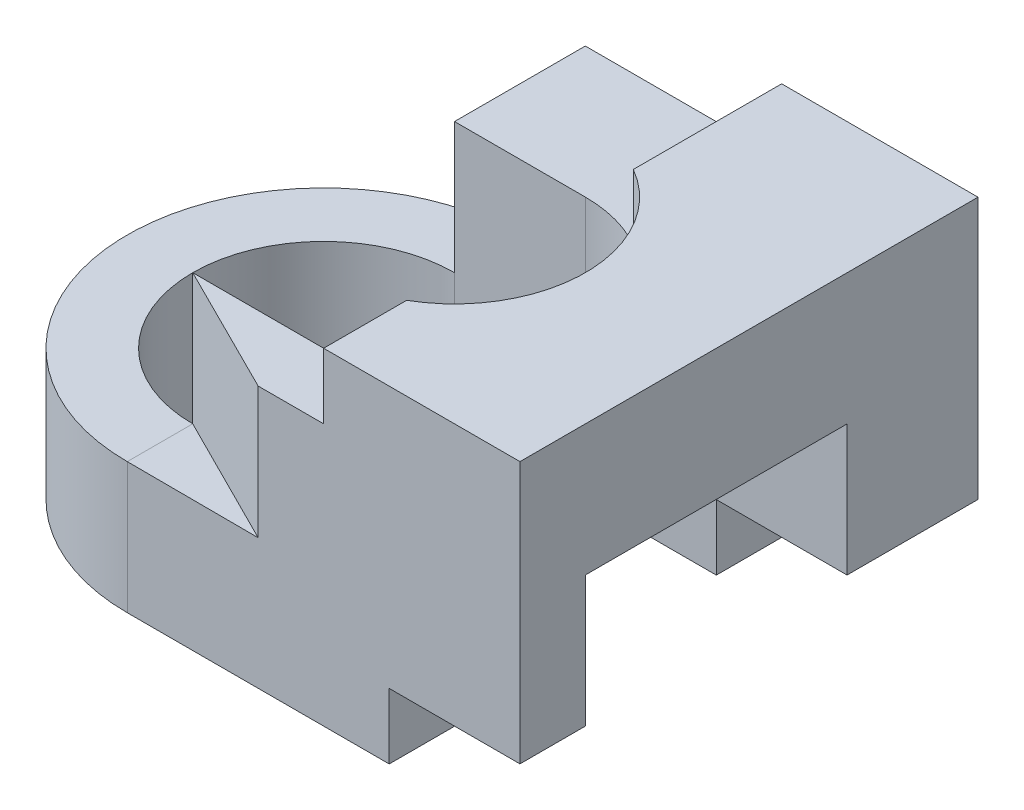
ISO-10303-21;
HEADER;
FILE_DESCRIPTION(('STEP AP214'),'2;1');
FILE_NAME('part.step','',(''),(''),'','','');
FILE_SCHEMA(('AUTOMOTIVE_DESIGN { 1 0 10303 214 1 1 1 1 }'));
ENDSEC;
DATA;
#1=APPLICATION_CONTEXT('core data for automotive mechanical design processes');
#2=APPLICATION_PROTOCOL_DEFINITION('international standard','automotive_design',2000,#1);
#3=PRODUCT_CONTEXT('',#1,'mechanical');
#4=PRODUCT('Part','Part','',(#3));
#5=PRODUCT_RELATED_PRODUCT_CATEGORY('part','',(#4));
#6=PRODUCT_DEFINITION_FORMATION('','',#4);
#7=PRODUCT_DEFINITION_CONTEXT('part definition',#1,'design');
#8=PRODUCT_DEFINITION('design','',#6,#7);
#9=PRODUCT_DEFINITION_SHAPE('','',#8);
#10=(LENGTH_UNIT() NAMED_UNIT(*) SI_UNIT(.MILLI.,.METRE.));
#11=(NAMED_UNIT(*) PLANE_ANGLE_UNIT() SI_UNIT($,.RADIAN.));
#12=(NAMED_UNIT(*) SI_UNIT($,.STERADIAN.) SOLID_ANGLE_UNIT());
#13=UNCERTAINTY_MEASURE_WITH_UNIT(LENGTH_MEASURE(1.E-05),#10,'distance_accuracy_value','');
#14=(GEOMETRIC_REPRESENTATION_CONTEXT(3) GLOBAL_UNCERTAINTY_ASSIGNED_CONTEXT((#13)) GLOBAL_UNIT_ASSIGNED_CONTEXT((#10,
#11,#12)) REPRESENTATION_CONTEXT('',''));
#15=CARTESIAN_POINT('',(0.,0.,0.));
#16=DIRECTION('',(0.,0.,1.));
#17=DIRECTION('',(1.,0.,0.));
#18=AXIS2_PLACEMENT_3D('',#15,#16,#17);
#19=CARTESIAN_POINT('',(4.00235173542104,1.,3.));
#20=DIRECTION('',(-1.,0.,0.));
#21=DIRECTION('',(0.,0.,1.));
#22=AXIS2_PLACEMENT_3D('',#19,#20,#21);
#23=PLANE('',#22);
#24=DIRECTION('',(0.,0.,-1.));
#25=VECTOR('',#24,1.);
#26=CARTESIAN_POINT('',(4.00235173542104,0.,3.));
#27=LINE('',#26,#25);
#28=CARTESIAN_POINT('',(4.00235173542104,0.,3.));
#29=VERTEX_POINT('',#28);
#30=CARTESIAN_POINT('',(4.00235173542104,0.,2.));
#31=VERTEX_POINT('',#30);
#32=EDGE_CURVE('E255',#29,#31,#27,.T.);
#33=ORIENTED_EDGE('',*,*,#32,.T.);
#34=DIRECTION('',(0.,1.,0.));
#35=VECTOR('',#34,1.);
#36=CARTESIAN_POINT('',(4.00235173542104,1.,2.));
#37=LINE('',#36,#35);
#38=CARTESIAN_POINT('',(4.00235173542104,1.,2.));
#39=VERTEX_POINT('',#38);
#40=EDGE_CURVE('E236',#31,#39,#37,.T.);
#41=ORIENTED_EDGE('',*,*,#40,.T.);
#42=DIRECTION('',(0.,0.,-1.));
#43=VECTOR('',#42,1.);
#44=CARTESIAN_POINT('',(4.00235173542104,1.,3.));
#45=LINE('',#44,#43);
#46=CARTESIAN_POINT('',(4.00235173542104,1.,3.));
#47=VERTEX_POINT('',#46);
#48=EDGE_CURVE('E250',#47,#39,#45,.T.);
#49=ORIENTED_EDGE('',*,*,#48,.F.);
#50=DIRECTION('',(0.,-1.,0.));
#51=VECTOR('',#50,1.);
#52=CARTESIAN_POINT('',(4.00235173542104,1.,3.));
#53=LINE('',#52,#51);
#54=EDGE_CURVE('E254',#47,#29,#53,.T.);
#55=ORIENTED_EDGE('',*,*,#54,.T.);
#56=EDGE_LOOP('',(#33,#41,#49,#55));
#57=FACE_BOUND('',#56,.T.);
#58=ADVANCED_FACE('F34',(#57),#23,.F.);
#59=CARTESIAN_POINT('',(0.,1.,0.));
#60=DIRECTION('',(0.,1.,0.));
#61=DIRECTION('',(0.,0.,1.));
#62=AXIS2_PLACEMENT_3D('',#59,#60,#61);
#63=PLANE('',#62);
#64=ORIENTED_EDGE('',*,*,#48,.T.);
#65=DIRECTION('',(1.,0.,0.));
#66=VECTOR('',#65,1.);
#67=CARTESIAN_POINT('',(0.,1.,2.));
#68=LINE('',#67,#66);
#69=CARTESIAN_POINT('',(6.,1.,2.));
#70=VERTEX_POINT('',#69);
#71=EDGE_CURVE('E12',#39,#70,#68,.T.);
#72=ORIENTED_EDGE('',*,*,#71,.T.);
#73=DIRECTION('',(0.,0.,1.));
#74=VECTOR('',#73,1.);
#75=CARTESIAN_POINT('',(6.,1.,3.));
#76=LINE('',#75,#74);
#77=CARTESIAN_POINT('',(6.,1.,3.));
#78=VERTEX_POINT('',#77);
#79=EDGE_CURVE('E246',#70,#78,#76,.T.);
#80=ORIENTED_EDGE('',*,*,#79,.T.);
#81=DIRECTION('',(-1.,0.,0.));
#82=VECTOR('',#81,1.);
#83=CARTESIAN_POINT('',(6.,1.,3.));
#84=LINE('',#83,#82);
#85=EDGE_CURVE('E245',#78,#47,#84,.T.);
#86=ORIENTED_EDGE('',*,*,#85,.T.);
#87=EDGE_LOOP('',(#64,#72,#80,#86));
#88=FACE_BOUND('',#87,.T.);
#89=ADVANCED_FACE('F440',(#88),#63,.F.);
#90=CARTESIAN_POINT('',(0.,5.,0.));
#91=DIRECTION('',(0.,1.,0.));
#92=DIRECTION('',(0.,0.,1.));
#93=AXIS2_PLACEMENT_3D('',#90,#91,#92);
#94=PLANE('',#93);
#95=DIRECTION('',(-1.,0.,0.));
#96=VECTOR('',#95,1.);
#97=CARTESIAN_POINT('',(0.,5.,-3.99836020882143));
#98=LINE('',#97,#96);
#99=CARTESIAN_POINT('',(6.,5.,-3.99836020882143));
#100=VERTEX_POINT('',#99);
#101=CARTESIAN_POINT('',(3.,5.,-3.99836020882143));
#102=VERTEX_POINT('',#101);
#103=EDGE_CURVE('E323',#100,#102,#98,.T.);
#104=ORIENTED_EDGE('',*,*,#103,.T.);
#105=DIRECTION('',(0.,0.,1.));
#106=VECTOR('',#105,1.);
#107=CARTESIAN_POINT('',(3.,5.,-4.));
#108=LINE('',#107,#106);
#109=CARTESIAN_POINT('',(3.,5.,-1.73205080756888));
#110=VERTEX_POINT('',#109);
#111=EDGE_CURVE('E271',#102,#110,#108,.T.);
#112=ORIENTED_EDGE('',*,*,#111,.T.);
#113=CARTESIAN_POINT('',(2.,5.,0.));
#114=DIRECTION('',(0.,1.,0.));
#115=DIRECTION('',(0.,0.,-1.));
#116=AXIS2_PLACEMENT_3D('',#113,#114,#115);
#117=CIRCLE('',#116,2.);
#118=CARTESIAN_POINT('',(3.,5.,1.73205080756888));
#119=VERTEX_POINT('',#118);
#120=EDGE_CURVE('E296',#119,#110,#117,.T.);
#121=ORIENTED_EDGE('',*,*,#120,.F.);
#122=CARTESIAN_POINT('',(3.,5.,3.));
#123=VERTEX_POINT('',#122);
#124=EDGE_CURVE('E391',#119,#123,#108,.T.);
#125=ORIENTED_EDGE('',*,*,#124,.T.);
#126=DIRECTION('',(1.,0.,0.));
#127=VECTOR('',#126,1.);
#128=CARTESIAN_POINT('',(6.,5.,3.));
#129=LINE('',#128,#127);
#130=CARTESIAN_POINT('',(6.,5.,3.));
#131=VERTEX_POINT('',#130);
#132=EDGE_CURVE('E318',#123,#131,#129,.T.);
#133=ORIENTED_EDGE('',*,*,#132,.T.);
#134=DIRECTION('',(0.,0.,-1.));
#135=VECTOR('',#134,1.);
#136=CARTESIAN_POINT('',(6.,5.,-3.99836020882143));
#137=LINE('',#136,#135);
#138=EDGE_CURVE('E320',#131,#100,#137,.T.);
#139=ORIENTED_EDGE('',*,*,#138,.T.);
#140=EDGE_LOOP('',(#104,#112,#121,#125,#133,#139));
#141=FACE_BOUND('',#140,.T.);
#142=ADVANCED_FACE('F397',(#141),#94,.T.);
#143=CARTESIAN_POINT('',(0.,5.,0.));
#144=DIRECTION('',(0.,-1.,0.));
#145=DIRECTION('',(0.,0.,-1.));
#146=AXIS2_PLACEMENT_3D('',#143,#144,#145);
#147=CYLINDRICAL_SURFACE('',#146,3.);
#148=CARTESIAN_POINT('',(0.,2.,0.));
#149=DIRECTION('',(0.,1.,0.));
#150=DIRECTION('',(-1.,0.,0.));
#151=AXIS2_PLACEMENT_3D('',#148,#149,#150);
#152=CIRCLE('',#151,3.);
#153=CARTESIAN_POINT('',(0.,2.,-3.));
#154=VERTEX_POINT('',#153);
#155=CARTESIAN_POINT('',(0.,2.,3.));
#156=VERTEX_POINT('',#155);
#157=EDGE_CURVE('E293',#154,#156,#152,.T.);
#158=ORIENTED_EDGE('',*,*,#157,.F.);
#159=DIRECTION('',(0.,-1.,0.));
#160=VECTOR('',#159,1.);
#161=CARTESIAN_POINT('',(0.,5.,-3.));
#162=LINE('',#161,#160);
#163=CARTESIAN_POINT('',(0.,0.,-3.));
#164=VERTEX_POINT('',#163);
#165=EDGE_CURVE('E326',#154,#164,#162,.T.);
#166=ORIENTED_EDGE('',*,*,#165,.T.);
#167=CARTESIAN_POINT('',(0.,0.,0.));
#168=DIRECTION('',(0.,1.,0.));
#169=DIRECTION('',(0.,0.,1.));
#170=AXIS2_PLACEMENT_3D('',#167,#168,#169);
#171=CIRCLE('',#170,3.);
#172=CARTESIAN_POINT('',(0.,0.,3.));
#173=VERTEX_POINT('',#172);
#174=EDGE_CURVE('E327',#164,#173,#171,.T.);
#175=ORIENTED_EDGE('',*,*,#174,.T.);
#176=DIRECTION('',(0.,-1.,0.));
#177=VECTOR('',#176,1.);
#178=CARTESIAN_POINT('',(0.,5.,3.));
#179=LINE('',#178,#177);
#180=EDGE_CURVE('E347',#156,#173,#179,.T.);
#181=ORIENTED_EDGE('',*,*,#180,.F.);
#182=EDGE_LOOP('',(#158,#166,#175,#181));
#183=FACE_BOUND('',#182,.T.);
#184=ADVANCED_FACE('F36',(#183),#147,.T.);
#185=CARTESIAN_POINT('',(6.,5.,3.));
#186=DIRECTION('',(0.,0.,-1.));
#187=DIRECTION('',(-1.,0.,0.));
#188=AXIS2_PLACEMENT_3D('',#185,#186,#187);
#189=PLANE('',#188);
#190=DIRECTION('',(-1.,0.,0.));
#191=VECTOR('',#190,1.);
#192=CARTESIAN_POINT('',(0.,4.,3.));
#193=LINE('',#192,#191);
#194=CARTESIAN_POINT('',(3.,4.,3.));
#195=VERTEX_POINT('',#194);
#196=CARTESIAN_POINT('',(2.,4.,3.));
#197=VERTEX_POINT('',#196);
#198=EDGE_CURVE('E208',#195,#197,#193,.T.);
#199=ORIENTED_EDGE('',*,*,#198,.T.);
#200=DIRECTION('',(0.,1.,0.));
#201=VECTOR('',#200,1.);
#202=CARTESIAN_POINT('',(2.,4.,3.));
#203=LINE('',#202,#201);
#204=CARTESIAN_POINT('',(2.,1.99251811698804,3.));
#205=VERTEX_POINT('',#204);
#206=EDGE_CURVE('E199',#205,#197,#203,.T.);
#207=ORIENTED_EDGE('',*,*,#206,.F.);
#208=DIRECTION('',(-0.999993002751767,0.00374091532968507,0.));
#209=VECTOR('',#208,1.);
#210=CARTESIAN_POINT('',(5.98869336585426,1.97759664842108,3.));
#211=LINE('',#210,#209);
#212=EDGE_CURVE('E186',#205,#156,#211,.T.);
#213=ORIENTED_EDGE('',*,*,#212,.T.);
#214=ORIENTED_EDGE('',*,*,#180,.T.);
#215=DIRECTION('',(1.,0.,0.));
#216=VECTOR('',#215,1.);
#217=CARTESIAN_POINT('',(6.,0.,3.));
#218=LINE('',#217,#216);
#219=EDGE_CURVE('E330',#173,#29,#218,.T.);
#220=ORIENTED_EDGE('',*,*,#219,.T.);
#221=ORIENTED_EDGE('',*,*,#54,.F.);
#222=ORIENTED_EDGE('',*,*,#85,.F.);
#223=DIRECTION('',(0.,-1.,0.));
#224=VECTOR('',#223,1.);
#225=CARTESIAN_POINT('',(6.,5.,3.));
#226=LINE('',#225,#224);
#227=EDGE_CURVE('E344',#131,#78,#226,.T.);
#228=ORIENTED_EDGE('',*,*,#227,.F.);
#229=ORIENTED_EDGE('',*,*,#132,.F.);
#230=DIRECTION('',(0.,-1.,0.));
#231=VECTOR('',#230,1.);
#232=CARTESIAN_POINT('',(3.,0.,3.));
#233=LINE('',#232,#231);
#234=EDGE_CURVE('E264',#123,#195,#233,.T.);
#235=ORIENTED_EDGE('',*,*,#234,.T.);
#236=EDGE_LOOP('',(#199,#207,#213,#214,#220,#221,#222,#228,#229,#235));
#237=FACE_BOUND('',#236,.T.);
#238=ADVANCED_FACE('F205',(#237),#189,.F.);
#239=CARTESIAN_POINT('',(0.,5.,-3.99836020882143));
#240=DIRECTION('',(0.,0.,1.));
#241=DIRECTION('',(1.,0.,0.));
#242=AXIS2_PLACEMENT_3D('',#239,#240,#241);
#243=PLANE('',#242);
#244=DIRECTION('',(1.,0.,0.));
#245=VECTOR('',#244,1.);
#246=CARTESIAN_POINT('',(6.,1.,-3.99836020882143));
#247=LINE('',#246,#245);
#248=CARTESIAN_POINT('',(4.00235173542104,1.,-3.99836020882143));
#249=VERTEX_POINT('',#248);
#250=CARTESIAN_POINT('',(6.,1.,-3.99836020882143));
#251=VERTEX_POINT('',#250);
#252=EDGE_CURVE('E59',#249,#251,#247,.T.);
#253=ORIENTED_EDGE('',*,*,#252,.F.);
#254=DIRECTION('',(0.,-1.,0.));
#255=VECTOR('',#254,1.);
#256=CARTESIAN_POINT('',(4.00235173542104,1.,-3.99836020882143));
#257=LINE('',#256,#255);
#258=CARTESIAN_POINT('',(4.00235173542104,0.,-3.99836020882143));
#259=VERTEX_POINT('',#258);
#260=EDGE_CURVE('E258',#249,#259,#257,.T.);
#261=ORIENTED_EDGE('',*,*,#260,.T.);
#262=DIRECTION('',(-1.,0.,0.));
#263=VECTOR('',#262,1.);
#264=CARTESIAN_POINT('',(0.,0.,-3.99836020882143));
#265=LINE('',#264,#263);
#266=CARTESIAN_POINT('',(0.,0.,-3.99836020882143));
#267=VERTEX_POINT('',#266);
#268=EDGE_CURVE('E333',#259,#267,#265,.T.);
#269=ORIENTED_EDGE('',*,*,#268,.T.);
#270=DIRECTION('',(0.,-1.,0.));
#271=VECTOR('',#270,1.);
#272=CARTESIAN_POINT('',(0.,5.,-3.99836020882143));
#273=LINE('',#272,#271);
#274=CARTESIAN_POINT('',(0.,4.,-3.99836020882143));
#275=VERTEX_POINT('',#274);
#276=EDGE_CURVE('E338',#275,#267,#273,.T.);
#277=ORIENTED_EDGE('',*,*,#276,.F.);
#278=DIRECTION('',(-1.,0.,0.));
#279=VECTOR('',#278,1.);
#280=CARTESIAN_POINT('',(0.,4.,-3.99836020882143));
#281=LINE('',#280,#279);
#282=CARTESIAN_POINT('',(3.,4.,-3.99836020882143));
#283=VERTEX_POINT('',#282);
#284=EDGE_CURVE('E287',#283,#275,#281,.T.);
#285=ORIENTED_EDGE('',*,*,#284,.F.);
#286=DIRECTION('',(0.,-1.,0.));
#287=VECTOR('',#286,1.);
#288=CARTESIAN_POINT('',(3.,5.,-3.99836020882143));
#289=LINE('',#288,#287);
#290=EDGE_CURVE('E290',#102,#283,#289,.T.);
#291=ORIENTED_EDGE('',*,*,#290,.F.);
#292=ORIENTED_EDGE('',*,*,#103,.F.);
#293=DIRECTION('',(0.,-1.,0.));
#294=VECTOR('',#293,1.);
#295=CARTESIAN_POINT('',(6.,5.,-3.99836020882143));
#296=LINE('',#295,#294);
#297=EDGE_CURVE('E341',#100,#251,#296,.T.);
#298=ORIENTED_EDGE('',*,*,#297,.T.);
#299=EDGE_LOOP('',(#253,#261,#269,#277,#285,#291,#292,#298));
#300=FACE_BOUND('',#299,.T.);
#301=ADVANCED_FACE('F409',(#300),#243,.F.);
#302=CARTESIAN_POINT('',(0.,5.,-3.));
#303=DIRECTION('',(1.,0.,0.));
#304=DIRECTION('',(0.,0.,-1.));
#305=AXIS2_PLACEMENT_3D('',#302,#303,#304);
#306=PLANE('',#305);
#307=ORIENTED_EDGE('',*,*,#165,.F.);
#308=DIRECTION('',(0.,0.,1.));
#309=VECTOR('',#308,1.);
#310=CARTESIAN_POINT('',(0.,2.,-4.));
#311=LINE('',#310,#309);
#312=CARTESIAN_POINT('',(0.,2.,-2.));
#313=VERTEX_POINT('',#312);
#314=EDGE_CURVE('E276',#154,#313,#311,.T.);
#315=ORIENTED_EDGE('',*,*,#314,.T.);
#316=DIRECTION('',(0.,-1.,0.));
#317=VECTOR('',#316,1.);
#318=CARTESIAN_POINT('',(0.,5.,-2.));
#319=LINE('',#318,#317);
#320=CARTESIAN_POINT('',(0.,4.,-2.));
#321=VERTEX_POINT('',#320);
#322=EDGE_CURVE('E310',#321,#313,#319,.T.);
#323=ORIENTED_EDGE('',*,*,#322,.F.);
#324=DIRECTION('',(0.,0.,1.));
#325=VECTOR('',#324,1.);
#326=CARTESIAN_POINT('',(0.,4.,-4.));
#327=LINE('',#326,#325);
#328=EDGE_CURVE('E282',#275,#321,#327,.T.);
#329=ORIENTED_EDGE('',*,*,#328,.F.);
#330=ORIENTED_EDGE('',*,*,#276,.T.);
#331=DIRECTION('',(0.,0.,1.));
#332=VECTOR('',#331,1.);
#333=CARTESIAN_POINT('',(0.,0.,-3.));
#334=LINE('',#333,#332);
#335=EDGE_CURVE('E321',#267,#164,#334,.T.);
#336=ORIENTED_EDGE('',*,*,#335,.T.);
#337=EDGE_LOOP('',(#307,#315,#323,#329,#330,#336));
#338=FACE_BOUND('',#337,.T.);
#339=ADVANCED_FACE('F414',(#338),#306,.F.);
#340=CARTESIAN_POINT('',(0.,5.,0.));
#341=DIRECTION('',(0.,-1.,0.));
#342=DIRECTION('',(0.,0.,-1.));
#343=AXIS2_PLACEMENT_3D('',#340,#341,#342);
#344=CYLINDRICAL_SURFACE('',#343,2.);
#345=CARTESIAN_POINT('',(0.,0.,-2.));
#346=VERTEX_POINT('',#345);
#347=EDGE_CURVE('E299',#313,#346,#319,.T.);
#348=ORIENTED_EDGE('',*,*,#347,.F.);
#349=CARTESIAN_POINT('',(0.,2.,0.));
#350=DIRECTION('',(0.,1.,0.));
#351=DIRECTION('',(-1.,0.,0.));
#352=AXIS2_PLACEMENT_3D('',#349,#350,#351);
#353=CIRCLE('',#352,2.);
#354=CARTESIAN_POINT('',(0.,2.,2.));
#355=VERTEX_POINT('',#354);
#356=EDGE_CURVE('E277',#313,#355,#353,.T.);
#357=ORIENTED_EDGE('',*,*,#356,.T.);
#358=DIRECTION('',(0.,-1.,0.));
#359=VECTOR('',#358,1.);
#360=CARTESIAN_POINT('',(0.,5.,2.));
#361=LINE('',#360,#359);
#362=CARTESIAN_POINT('',(0.,0.,2.));
#363=VERTEX_POINT('',#362);
#364=EDGE_CURVE('E317',#355,#363,#361,.T.);
#365=ORIENTED_EDGE('',*,*,#364,.T.);
#366=CARTESIAN_POINT('',(0.,0.,0.));
#367=DIRECTION('',(0.,1.,0.));
#368=DIRECTION('',(0.,0.,1.));
#369=AXIS2_PLACEMENT_3D('',#366,#367,#368);
#370=CIRCLE('',#369,2.);
#371=EDGE_CURVE('E295',#346,#363,#370,.T.);
#372=ORIENTED_EDGE('',*,*,#371,.F.);
#373=EDGE_LOOP('',(#348,#357,#365,#372));
#374=FACE_BOUND('',#373,.T.);
#375=ADVANCED_FACE('F363',(#374),#344,.F.);
#376=CARTESIAN_POINT('',(2.,5.,2.));
#377=DIRECTION('',(0.,0.,-1.));
#378=DIRECTION('',(-1.,0.,0.));
#379=AXIS2_PLACEMENT_3D('',#376,#377,#378);
#380=PLANE('',#379);
#381=DIRECTION('',(0.,1.,0.));
#382=VECTOR('',#381,1.);
#383=CARTESIAN_POINT('',(0.,5.,2.));
#384=LINE('',#383,#382);
#385=CARTESIAN_POINT('',(0.,4.,2.));
#386=VERTEX_POINT('',#385);
#387=EDGE_CURVE('E202',#355,#386,#384,.T.);
#388=ORIENTED_EDGE('',*,*,#387,.T.);
#389=DIRECTION('',(1.,0.,0.));
#390=VECTOR('',#389,1.);
#391=CARTESIAN_POINT('',(2.,4.,2.));
#392=LINE('',#391,#390);
#393=CARTESIAN_POINT('',(2.,4.,2.));
#394=VERTEX_POINT('',#393);
#395=EDGE_CURVE('E291',#386,#394,#392,.T.);
#396=ORIENTED_EDGE('',*,*,#395,.T.);
#397=DIRECTION('',(0.,-1.,0.));
#398=VECTOR('',#397,1.);
#399=CARTESIAN_POINT('',(2.,5.,2.));
#400=LINE('',#399,#398);
#401=CARTESIAN_POINT('',(2.,3.,2.));
#402=VERTEX_POINT('',#401);
#403=EDGE_CURVE('E314',#394,#402,#400,.T.);
#404=ORIENTED_EDGE('',*,*,#403,.T.);
#405=DIRECTION('',(-1.,0.,0.));
#406=VECTOR('',#405,1.);
#407=CARTESIAN_POINT('',(0.,3.,2.));
#408=LINE('',#407,#406);
#409=CARTESIAN_POINT('',(6.,3.,2.));
#410=VERTEX_POINT('',#409);
#411=EDGE_CURVE('E225',#410,#402,#408,.T.);
#412=ORIENTED_EDGE('',*,*,#411,.F.);
#413=DIRECTION('',(0.,-1.,0.));
#414=VECTOR('',#413,1.);
#415=CARTESIAN_POINT('',(6.,3.,2.));
#416=LINE('',#415,#414);
#417=EDGE_CURVE('E229',#410,#70,#416,.T.);
#418=ORIENTED_EDGE('',*,*,#417,.T.);
#419=ORIENTED_EDGE('',*,*,#71,.F.);
#420=ORIENTED_EDGE('',*,*,#40,.F.);
#421=DIRECTION('',(1.,0.,0.));
#422=VECTOR('',#421,1.);
#423=CARTESIAN_POINT('',(2.,0.,2.));
#424=LINE('',#423,#422);
#425=EDGE_CURVE('E303',#363,#31,#424,.T.);
#426=ORIENTED_EDGE('',*,*,#425,.F.);
#427=ORIENTED_EDGE('',*,*,#364,.F.);
#428=EDGE_LOOP('',(#388,#396,#404,#412,#418,#419,#420,#426,#427));
#429=FACE_BOUND('',#428,.T.);
#430=ADVANCED_FACE('F370',(#429),#380,.T.);
#431=CARTESIAN_POINT('',(2.,5.,0.));
#432=DIRECTION('',(0.,-1.,0.));
#433=DIRECTION('',(0.,0.,-1.));
#434=AXIS2_PLACEMENT_3D('',#431,#432,#433);
#435=CYLINDRICAL_SURFACE('',#434,2.);
#436=DIRECTION('',(0.,-1.,0.));
#437=VECTOR('',#436,1.);
#438=CARTESIAN_POINT('',(2.09512028970522,5.,-1.99773675204878));
#439=LINE('',#438,#437);
#440=CARTESIAN_POINT('',(2.09512028970522,3.,-1.99773675204878));
#441=VERTEX_POINT('',#440);
#442=CARTESIAN_POINT('',(2.09512028970522,0.,-1.99773675204878));
#443=VERTEX_POINT('',#442);
#444=EDGE_CURVE('E234',#441,#443,#439,.T.);
#445=ORIENTED_EDGE('',*,*,#444,.F.);
#446=CARTESIAN_POINT('',(2.,3.,0.));
#447=DIRECTION('',(0.,-1.,0.));
#448=DIRECTION('',(0.,0.,-1.));
#449=AXIS2_PLACEMENT_3D('',#446,#447,#448);
#450=CIRCLE('',#449,2.);
#451=EDGE_CURVE('E239',#441,#402,#450,.T.);
#452=ORIENTED_EDGE('',*,*,#451,.T.);
#453=ORIENTED_EDGE('',*,*,#403,.F.);
#454=CARTESIAN_POINT('',(2.,4.,0.));
#455=DIRECTION('',(0.,1.,0.));
#456=DIRECTION('',(0.,0.,1.));
#457=AXIS2_PLACEMENT_3D('',#454,#455,#456);
#458=CIRCLE('',#457,2.);
#459=CARTESIAN_POINT('',(3.,4.,1.73205080756888));
#460=VERTEX_POINT('',#459);
#461=EDGE_CURVE('E286',#394,#460,#458,.T.);
#462=ORIENTED_EDGE('',*,*,#461,.T.);
#463=DIRECTION('',(0.,-1.,0.));
#464=VECTOR('',#463,1.);
#465=CARTESIAN_POINT('',(3.,5.,1.73205080756888));
#466=LINE('',#465,#464);
#467=EDGE_CURVE('E352',#460,#119,#466,.F.);
#468=ORIENTED_EDGE('',*,*,#467,.T.);
#469=ORIENTED_EDGE('',*,*,#120,.T.);
#470=DIRECTION('',(0.,-1.,0.));
#471=VECTOR('',#470,1.);
#472=CARTESIAN_POINT('',(3.,5.,-1.73205080756888));
#473=LINE('',#472,#471);
#474=CARTESIAN_POINT('',(3.,4.,-1.73205080756888));
#475=VERTEX_POINT('',#474);
#476=EDGE_CURVE('E355',#110,#475,#473,.T.);
#477=ORIENTED_EDGE('',*,*,#476,.T.);
#478=CARTESIAN_POINT('',(2.,4.,-2.));
#479=VERTEX_POINT('',#478);
#480=EDGE_CURVE('E270',#475,#479,#458,.T.);
#481=ORIENTED_EDGE('',*,*,#480,.T.);
#482=DIRECTION('',(0.,-1.,0.));
#483=VECTOR('',#482,1.);
#484=CARTESIAN_POINT('',(2.,5.,-2.));
#485=LINE('',#484,#483);
#486=CARTESIAN_POINT('',(2.,0.,-2.));
#487=VERTEX_POINT('',#486);
#488=EDGE_CURVE('E311',#479,#487,#485,.T.);
#489=ORIENTED_EDGE('',*,*,#488,.T.);
#490=CARTESIAN_POINT('',(2.,0.,0.));
#491=DIRECTION('',(0.,1.,0.));
#492=DIRECTION('',(0.,0.,-1.));
#493=AXIS2_PLACEMENT_3D('',#490,#491,#492);
#494=CIRCLE('',#493,2.);
#495=EDGE_CURVE('E305',#443,#487,#494,.T.);
#496=ORIENTED_EDGE('',*,*,#495,.F.);
#497=EDGE_LOOP('',(#445,#452,#453,#462,#468,#469,#477,#481,#489,#496));
#498=FACE_BOUND('',#497,.T.);
#499=ADVANCED_FACE('F382',(#498),#435,.F.);
#500=CARTESIAN_POINT('',(0.,5.,-2.));
#501=DIRECTION('',(0.,0.,1.));
#502=DIRECTION('',(1.,0.,0.));
#503=AXIS2_PLACEMENT_3D('',#500,#501,#502);
#504=PLANE('',#503);
#505=ORIENTED_EDGE('',*,*,#488,.F.);
#506=DIRECTION('',(-1.,0.,0.));
#507=VECTOR('',#506,1.);
#508=CARTESIAN_POINT('',(0.,4.,-2.));
#509=LINE('',#508,#507);
#510=EDGE_CURVE('E349',#479,#321,#509,.T.);
#511=ORIENTED_EDGE('',*,*,#510,.T.);
#512=ORIENTED_EDGE('',*,*,#322,.T.);
#513=ORIENTED_EDGE('',*,*,#347,.T.);
#514=DIRECTION('',(-1.,0.,0.));
#515=VECTOR('',#514,1.);
#516=CARTESIAN_POINT('',(0.,0.,-2.));
#517=LINE('',#516,#515);
#518=EDGE_CURVE('E300',#487,#346,#517,.T.);
#519=ORIENTED_EDGE('',*,*,#518,.F.);
#520=EDGE_LOOP('',(#505,#511,#512,#513,#519));
#521=FACE_BOUND('',#520,.T.);
#522=ADVANCED_FACE('F471',(#521),#504,.T.);
#523=CARTESIAN_POINT('',(0.,0.,0.));
#524=DIRECTION('',(0.,1.,0.));
#525=DIRECTION('',(0.,0.,1.));
#526=AXIS2_PLACEMENT_3D('',#523,#524,#525);
#527=PLANE('',#526);
#528=ORIENTED_EDGE('',*,*,#425,.T.);
#529=ORIENTED_EDGE('',*,*,#32,.F.);
#530=ORIENTED_EDGE('',*,*,#219,.F.);
#531=ORIENTED_EDGE('',*,*,#174,.F.);
#532=ORIENTED_EDGE('',*,*,#335,.F.);
#533=ORIENTED_EDGE('',*,*,#268,.F.);
#534=CARTESIAN_POINT('',(4.00235173542104,0.,-1.99773675204878));
#535=VERTEX_POINT('',#534);
#536=EDGE_CURVE('E242',#535,#259,#27,.T.);
#537=ORIENTED_EDGE('',*,*,#536,.F.);
#538=DIRECTION('',(1.,0.,0.));
#539=VECTOR('',#538,1.);
#540=CARTESIAN_POINT('',(0.,0.,-1.99773675204878));
#541=LINE('',#540,#539);
#542=EDGE_CURVE('E195',#443,#535,#541,.T.);
#543=ORIENTED_EDGE('',*,*,#542,.F.);
#544=ORIENTED_EDGE('',*,*,#495,.T.);
#545=ORIENTED_EDGE('',*,*,#518,.T.);
#546=ORIENTED_EDGE('',*,*,#371,.T.);
#547=EDGE_LOOP('',(#528,#529,#530,#531,#532,#533,#537,#543,#544,#545,#546));
#548=FACE_BOUND('',#547,.T.);
#549=ADVANCED_FACE('F417',(#548),#527,.F.);
#550=CARTESIAN_POINT('',(6.,5.,-3.99836020882143));
#551=DIRECTION('',(-1.,0.,0.));
#552=DIRECTION('',(0.,0.,1.));
#553=AXIS2_PLACEMENT_3D('',#550,#551,#552);
#554=PLANE('',#553);
#555=ORIENTED_EDGE('',*,*,#79,.F.);
#556=ORIENTED_EDGE('',*,*,#417,.F.);
#557=DIRECTION('',(0.,0.,1.));
#558=VECTOR('',#557,1.);
#559=CARTESIAN_POINT('',(6.,3.,2.));
#560=LINE('',#559,#558);
#561=CARTESIAN_POINT('',(6.,3.,-1.99773675204878));
#562=VERTEX_POINT('',#561);
#563=EDGE_CURVE('E223',#562,#410,#560,.T.);
#564=ORIENTED_EDGE('',*,*,#563,.F.);
#565=DIRECTION('',(0.,-1.,0.));
#566=VECTOR('',#565,1.);
#567=CARTESIAN_POINT('',(6.,3.,-1.99773675204878));
#568=LINE('',#567,#566);
#569=CARTESIAN_POINT('',(6.,1.,-1.99773675204878));
#570=VERTEX_POINT('',#569);
#571=EDGE_CURVE('E227',#562,#570,#568,.T.);
#572=ORIENTED_EDGE('',*,*,#571,.T.);
#573=EDGE_CURVE('E243',#251,#570,#76,.T.);
#574=ORIENTED_EDGE('',*,*,#573,.F.);
#575=ORIENTED_EDGE('',*,*,#297,.F.);
#576=ORIENTED_EDGE('',*,*,#138,.F.);
#577=ORIENTED_EDGE('',*,*,#227,.T.);
#578=EDGE_LOOP('',(#555,#556,#564,#572,#574,#575,#576,#577));
#579=FACE_BOUND('',#578,.T.);
#580=ADVANCED_FACE('F425',(#579),#554,.F.);
#581=CARTESIAN_POINT('',(0.,2.,-4.));
#582=DIRECTION('',(0.,1.,0.));
#583=DIRECTION('',(-1.,0.,0.));
#584=AXIS2_PLACEMENT_3D('',#581,#582,#583);
#585=PLANE('',#584);
#586=ORIENTED_EDGE('',*,*,#157,.T.);
#587=EDGE_CURVE('E191',#355,#156,#311,.T.);
#588=ORIENTED_EDGE('',*,*,#587,.F.);
#589=ORIENTED_EDGE('',*,*,#356,.F.);
#590=ORIENTED_EDGE('',*,*,#314,.F.);
#591=EDGE_LOOP('',(#586,#588,#589,#590));
#592=FACE_BOUND('',#591,.T.);
#593=ADVANCED_FACE('F423',(#592),#585,.T.);
#594=CARTESIAN_POINT('',(3.,0.,-4.));
#595=DIRECTION('',(-1.,0.,0.));
#596=DIRECTION('',(0.,0.,1.));
#597=AXIS2_PLACEMENT_3D('',#594,#595,#596);
#598=PLANE('',#597);
#599=ORIENTED_EDGE('',*,*,#290,.T.);
#600=DIRECTION('',(0.,0.,1.));
#601=VECTOR('',#600,1.);
#602=CARTESIAN_POINT('',(3.,4.,-4.));
#603=LINE('',#602,#601);
#604=EDGE_CURVE('E389',#283,#475,#603,.T.);
#605=ORIENTED_EDGE('',*,*,#604,.T.);
#606=ORIENTED_EDGE('',*,*,#476,.F.);
#607=ORIENTED_EDGE('',*,*,#111,.F.);
#608=EDGE_LOOP('',(#599,#605,#606,#607));
#609=FACE_BOUND('',#608,.T.);
#610=ADVANCED_FACE('F402',(#609),#598,.T.);
#611=CARTESIAN_POINT('',(0.,4.,-4.));
#612=DIRECTION('',(0.,1.,0.));
#613=DIRECTION('',(0.,0.,1.));
#614=AXIS2_PLACEMENT_3D('',#611,#612,#613);
#615=PLANE('',#614);
#616=ORIENTED_EDGE('',*,*,#284,.T.);
#617=ORIENTED_EDGE('',*,*,#328,.T.);
#618=ORIENTED_EDGE('',*,*,#510,.F.);
#619=ORIENTED_EDGE('',*,*,#480,.F.);
#620=ORIENTED_EDGE('',*,*,#604,.F.);
#621=EDGE_LOOP('',(#616,#617,#618,#619,#620));
#622=FACE_BOUND('',#621,.T.);
#623=ADVANCED_FACE('F406',(#622),#615,.T.);
#624=DIRECTION('',(-0.894427190999914,0.,-0.447213595499962));
#625=VECTOR('',#624,1.);
#626=CARTESIAN_POINT('',(0.,4.,2.));
#627=LINE('',#626,#625);
#628=EDGE_CURVE('E209',#197,#386,#627,.T.);
#629=ORIENTED_EDGE('',*,*,#628,.F.);
#630=ORIENTED_EDGE('',*,*,#198,.F.);
#631=EDGE_CURVE('E387',#460,#195,#603,.T.);
#632=ORIENTED_EDGE('',*,*,#631,.F.);
#633=ORIENTED_EDGE('',*,*,#461,.F.);
#634=ORIENTED_EDGE('',*,*,#395,.F.);
#635=EDGE_LOOP('',(#629,#630,#632,#633,#634));
#636=FACE_BOUND('',#635,.T.);
#637=ADVANCED_FACE('F386',(#636),#615,.T.);
#638=ORIENTED_EDGE('',*,*,#631,.T.);
#639=ORIENTED_EDGE('',*,*,#234,.F.);
#640=ORIENTED_EDGE('',*,*,#124,.F.);
#641=ORIENTED_EDGE('',*,*,#467,.F.);
#642=EDGE_LOOP('',(#638,#639,#640,#641));
#643=FACE_BOUND('',#642,.T.);
#644=ADVANCED_FACE('F433',(#643),#598,.T.);
#645=CARTESIAN_POINT('',(4.00235173542104,1.,-1.99773675204878));
#646=VERTEX_POINT('',#645);
#647=EDGE_CURVE('E249',#646,#249,#45,.T.);
#648=ORIENTED_EDGE('',*,*,#647,.F.);
#649=DIRECTION('',(0.,-1.,0.));
#650=VECTOR('',#649,1.);
#651=CARTESIAN_POINT('',(4.00235173542104,1.,-1.99773675204878));
#652=LINE('',#651,#650);
#653=EDGE_CURVE('E51',#646,#535,#652,.T.);
#654=ORIENTED_EDGE('',*,*,#653,.T.);
#655=ORIENTED_EDGE('',*,*,#536,.T.);
#656=ORIENTED_EDGE('',*,*,#260,.F.);
#657=EDGE_LOOP('',(#648,#654,#655,#656));
#658=FACE_BOUND('',#657,.T.);
#659=ADVANCED_FACE('F443',(#658),#23,.F.);
#660=ORIENTED_EDGE('',*,*,#573,.T.);
#661=DIRECTION('',(-1.,0.,0.));
#662=VECTOR('',#661,1.);
#663=CARTESIAN_POINT('',(0.,1.,-1.99773675204878));
#664=LINE('',#663,#662);
#665=EDGE_CURVE('E43',#570,#646,#664,.T.);
#666=ORIENTED_EDGE('',*,*,#665,.T.);
#667=ORIENTED_EDGE('',*,*,#647,.T.);
#668=ORIENTED_EDGE('',*,*,#252,.T.);
#669=EDGE_LOOP('',(#660,#666,#667,#668));
#670=FACE_BOUND('',#669,.T.);
#671=ADVANCED_FACE('F450',(#670),#63,.F.);
#672=CARTESIAN_POINT('',(0.,3.,-1.99773675204878));
#673=DIRECTION('',(0.,0.,-1.));
#674=DIRECTION('',(-1.,0.,0.));
#675=AXIS2_PLACEMENT_3D('',#672,#673,#674);
#676=PLANE('',#675);
#677=ORIENTED_EDGE('',*,*,#444,.T.);
#678=ORIENTED_EDGE('',*,*,#542,.T.);
#679=ORIENTED_EDGE('',*,*,#653,.F.);
#680=ORIENTED_EDGE('',*,*,#665,.F.);
#681=ORIENTED_EDGE('',*,*,#571,.F.);
#682=DIRECTION('',(1.,0.,0.));
#683=VECTOR('',#682,1.);
#684=CARTESIAN_POINT('',(0.,3.,-1.99773675204878));
#685=LINE('',#684,#683);
#686=EDGE_CURVE('E221',#441,#562,#685,.T.);
#687=ORIENTED_EDGE('',*,*,#686,.F.);
#688=EDGE_LOOP('',(#677,#678,#679,#680,#681,#687));
#689=FACE_BOUND('',#688,.T.);
#690=ADVANCED_FACE('F456',(#689),#676,.F.);
#691=CARTESIAN_POINT('',(0.,3.,0.));
#692=DIRECTION('',(0.,-1.,0.));
#693=DIRECTION('',(0.,0.,-1.));
#694=AXIS2_PLACEMENT_3D('',#691,#692,#693);
#695=PLANE('',#694);
#696=ORIENTED_EDGE('',*,*,#686,.T.);
#697=ORIENTED_EDGE('',*,*,#563,.T.);
#698=ORIENTED_EDGE('',*,*,#411,.T.);
#699=ORIENTED_EDGE('',*,*,#451,.F.);
#700=EDGE_LOOP('',(#696,#697,#698,#699));
#701=FACE_BOUND('',#700,.T.);
#702=ADVANCED_FACE('F500',(#701),#695,.T.);
#703=CARTESIAN_POINT('',(0.,2.,2.));
#704=DIRECTION('',(-0.00374091532968507,-0.999993002751767,0.));
#705=DIRECTION('',(0.999993002751767,-0.00374091532968507,0.));
#706=AXIS2_PLACEMENT_3D('',#703,#704,#705);
#707=PLANE('',#706);
#708=DIRECTION('',(0.894422184166139,-0.00334598107261766,0.447211092083074));
#709=VECTOR('',#708,1.);
#710=CARTESIAN_POINT('',(0.,2.,2.));
#711=LINE('',#710,#709);
#712=EDGE_CURVE('E189',#355,#205,#711,.T.);
#713=ORIENTED_EDGE('',*,*,#712,.F.);
#714=ORIENTED_EDGE('',*,*,#587,.T.);
#715=ORIENTED_EDGE('',*,*,#212,.F.);
#716=EDGE_LOOP('',(#713,#714,#715));
#717=FACE_BOUND('',#716,.T.);
#718=ADVANCED_FACE('F188',(#717),#707,.F.);
#719=CARTESIAN_POINT('',(-0.800000000000001,0.,1.59999999999998));
#720=DIRECTION('',(0.447213595499962,0.,-0.894427190999914));
#721=DIRECTION('',(-0.894427190999914,0.,-0.447213595499962));
#722=AXIS2_PLACEMENT_3D('',#719,#720,#721);
#723=PLANE('',#722);
#724=ORIENTED_EDGE('',*,*,#712,.T.);
#725=ORIENTED_EDGE('',*,*,#206,.T.);
#726=ORIENTED_EDGE('',*,*,#628,.T.);
#727=ORIENTED_EDGE('',*,*,#387,.F.);
#728=EDGE_LOOP('',(#724,#725,#726,#727));
#729=FACE_BOUND('',#728,.T.);
#730=ADVANCED_FACE('F198',(#729),#723,.F.);
#731=CLOSED_SHELL('',(#58,#89,#142,#184,#238,#301,#339,#375,#430,#499,#522,#549,#580,#593,#610,
#623,#637,#644,#659,#671,#690,#702,#718,#730));
#732=MANIFOLD_SOLID_BREP('B2',#731);
#733=ADVANCED_BREP_SHAPE_REPRESENTATION('',(#18,#732),#14);
#734=SHAPE_DEFINITION_REPRESENTATION(#9,#733);
ENDSEC;
END-ISO-10303-21;
